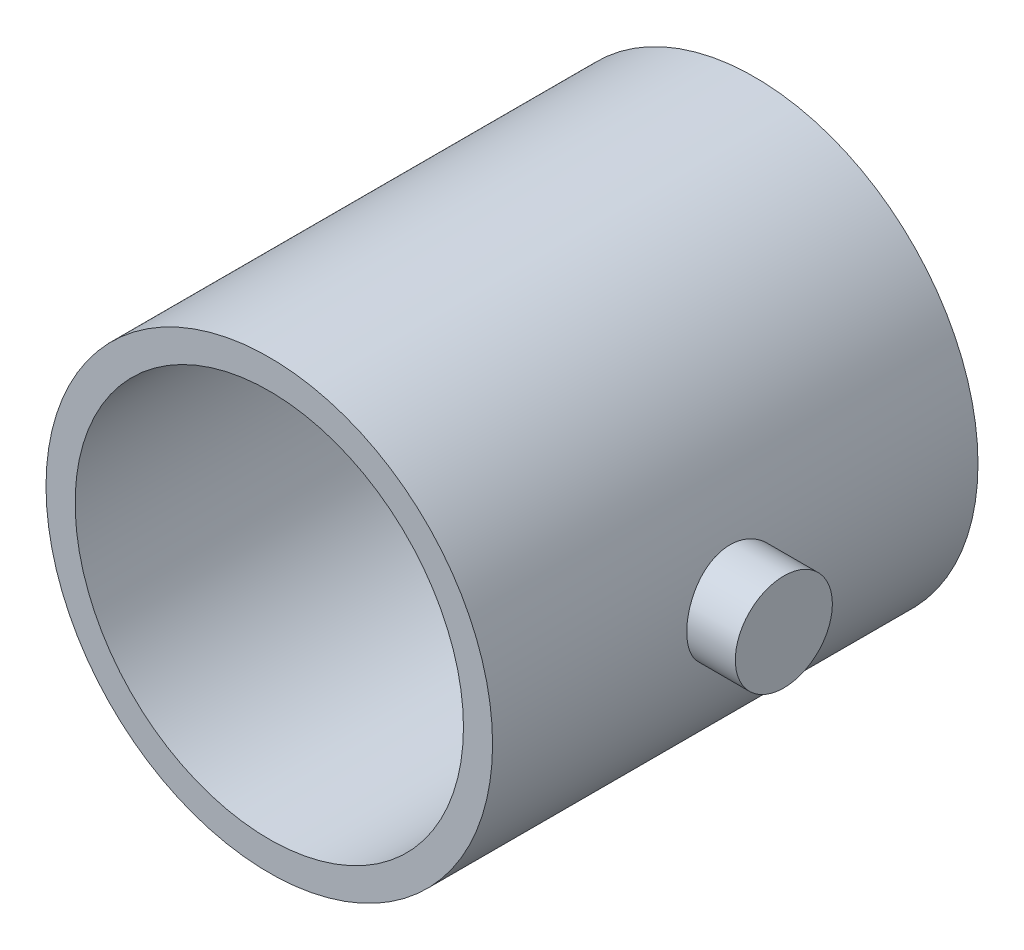
ISO-10303-21;
HEADER;
FILE_DESCRIPTION(('STEP AP214'),'2;1');
FILE_NAME('part.step','',(''),(''),'','','');
FILE_SCHEMA(('AUTOMOTIVE_DESIGN { 1 0 10303 214 1 1 1 1 }'));
ENDSEC;
DATA;
#1=APPLICATION_CONTEXT('core data for automotive mechanical design processes');
#2=APPLICATION_PROTOCOL_DEFINITION('international standard','automotive_design',2000,#1);
#3=PRODUCT_CONTEXT('',#1,'mechanical');
#4=PRODUCT('Part','Part','',(#3));
#5=PRODUCT_RELATED_PRODUCT_CATEGORY('part','',(#4));
#6=PRODUCT_DEFINITION_FORMATION('','',#4);
#7=PRODUCT_DEFINITION_CONTEXT('part definition',#1,'design');
#8=PRODUCT_DEFINITION('design','',#6,#7);
#9=PRODUCT_DEFINITION_SHAPE('','',#8);
#10=(LENGTH_UNIT() NAMED_UNIT(*) SI_UNIT(.MILLI.,.METRE.));
#11=(NAMED_UNIT(*) PLANE_ANGLE_UNIT() SI_UNIT($,.RADIAN.));
#12=(NAMED_UNIT(*) SI_UNIT($,.STERADIAN.) SOLID_ANGLE_UNIT());
#13=UNCERTAINTY_MEASURE_WITH_UNIT(LENGTH_MEASURE(1.E-05),#10,'distance_accuracy_value','');
#14=(GEOMETRIC_REPRESENTATION_CONTEXT(3) GLOBAL_UNCERTAINTY_ASSIGNED_CONTEXT((#13)) GLOBAL_UNIT_ASSIGNED_CONTEXT((#10,
#11,#12)) REPRESENTATION_CONTEXT('',''));
#15=CARTESIAN_POINT('',(0.,0.,0.));
#16=DIRECTION('',(0.,0.,1.));
#17=DIRECTION('',(1.,0.,0.));
#18=AXIS2_PLACEMENT_3D('',#15,#16,#17);
#19=CARTESIAN_POINT('',(1.11022302462516E-13,0.,24.9999999999999));
#20=DIRECTION('',(0.,0.,-1.));
#21=DIRECTION('',(-1.,0.,0.));
#22=AXIS2_PLACEMENT_3D('',#19,#20,#21);
#23=CYLINDRICAL_SURFACE('',#22,23.);
#24=CARTESIAN_POINT('',(1.11022302462516E-13,0.,24.9999999999999));
#25=DIRECTION('',(0.,0.,1.));
#26=DIRECTION('',(1.,0.,0.));
#27=AXIS2_PLACEMENT_3D('',#24,#25,#26);
#28=CIRCLE('',#27,23.);
#29=CARTESIAN_POINT('',(23.0000000000001,0.,24.9999999999999));
#30=VERTEX_POINT('',#29);
#31=EDGE_CURVE('E63',#30,#30,#28,.T.);
#32=ORIENTED_EDGE('',*,*,#31,.F.);
#33=EDGE_LOOP('',(#32));
#34=FACE_BOUND('',#33,.T.);
#35=CARTESIAN_POINT('',(0.,1.11022302462516E-13,-24.9999999999999));
#36=DIRECTION('',(0.,0.,1.));
#37=DIRECTION('',(1.,0.,0.));
#38=AXIS2_PLACEMENT_3D('',#35,#36,#37);
#39=CIRCLE('',#38,23.);
#40=CARTESIAN_POINT('',(23.,1.11022302462516E-13,-24.9999999999999));
#41=VERTEX_POINT('',#40);
#42=EDGE_CURVE('E67',#41,#41,#39,.T.);
#43=ORIENTED_EDGE('',*,*,#42,.T.);
#44=EDGE_LOOP('',(#43));
#45=FACE_BOUND('',#44,.T.);
#46=CARTESIAN_POINT('',(23.,0.,4.99999999999995));
#47=CARTESIAN_POINT('',(22.9999948787908,-0.277355453021735,4.99999046988133));
#48=CARTESIAN_POINT('',(22.9949320658385,-0.554826451597986,4.97684426926343));
#49=CARTESIAN_POINT('',(22.9752244645297,-1.10188982362927,4.88496546905839));
#50=CARTESIAN_POINT('',(22.9605727725136,-1.37147637435459,4.81620002471376));
#51=CARTESIAN_POINT('',(22.9233191130524,-1.89478531778498,4.63533607587976));
#52=CARTESIAN_POINT('',(22.9007254017299,-2.14852386391354,4.52328255955588));
#53=CARTESIAN_POINT('',(22.8500275043337,-2.63358953148524,4.25916536071906));
#54=CARTESIAN_POINT('',(22.8219234744707,-2.86491728796841,4.10710281237013));
#55=CARTESIAN_POINT('',(22.7627863133394,-3.30227374035058,3.76473115788667));
#56=CARTESIAN_POINT('',(22.7317172223452,-3.50789604525705,3.57390908094908));
#57=CARTESIAN_POINT('',(22.6704056016114,-3.88448132114956,3.16053646966976));
#58=CARTESIAN_POINT('',(22.640163145063,-4.05544123163071,2.93798313657933));
#59=CARTESIAN_POINT('',(22.5835746545546,-4.3596371455049,2.4644667572484));
#60=CARTESIAN_POINT('',(22.5572747128741,-4.49244139028528,2.21322034105574));
#61=CARTESIAN_POINT('',(22.5120647650812,-4.71378688871828,1.69131047335474));
#62=CARTESIAN_POINT('',(22.4931538869724,-4.80233336565282,1.42064931747878));
#63=CARTESIAN_POINT('',(22.4652292670019,-4.93130849540485,0.871998768853022));
#64=CARTESIAN_POINT('',(22.4560677930735,-4.97245619365541,0.59418608655001));
#65=CARTESIAN_POINT('',(22.4482355157402,-5.00770133737134,0.0354611643009783));
#66=CARTESIAN_POINT('',(22.4495634391116,-5.00180449319484,-0.245450695327375));
#67=CARTESIAN_POINT('',(22.4624261322471,-4.94370678921254,-0.797060666073154));
#68=CARTESIAN_POINT('',(22.4737769466231,-4.8923404136868,-1.06785160716687));
#69=CARTESIAN_POINT('',(22.5051157172029,-4.74608346550933,-1.59687823399914));
#70=CARTESIAN_POINT('',(22.5251041526852,-4.65119047766344,-1.85511322215649));
#71=CARTESIAN_POINT('',(22.5716477499978,-4.41980547322339,-2.35404788785901));
#72=CARTESIAN_POINT('',(22.598253368725,-4.28299185482642,-2.59459351716305));
#73=CARTESIAN_POINT('',(22.6550024959989,-3.97187541590613,-3.0496217824478));
#74=CARTESIAN_POINT('',(22.685146480994,-3.79756754406675,-3.26410090058628));
#75=CARTESIAN_POINT('',(22.7463657181789,-3.41198948927909,-3.66571305572729));
#76=CARTESIAN_POINT('',(22.7774471114846,-3.20000952055629,-3.85216437338838));
#77=CARTESIAN_POINT('',(22.8364526695469,-2.74743924196492,-4.18698068172868));
#78=CARTESIAN_POINT('',(22.8643767784509,-2.50684842612287,-4.33534499870512));
#79=CARTESIAN_POINT('',(22.9140103871413,-2.00305938410201,-4.58994109331086));
#80=CARTESIAN_POINT('',(22.9357068090615,-1.73981507074034,-4.69608438628192));
#81=CARTESIAN_POINT('',(22.9703430978099,-1.19865085335271,-4.86244154718178));
#82=CARTESIAN_POINT('',(22.9832842221095,-0.920733062974672,-4.92266201089122));
#83=CARTESIAN_POINT('',(22.9987731031789,-0.363959336093276,-4.99447447644619));
#84=CARTESIAN_POINT('',(23.0015198929516,-0.0852289048501575,-5.00699783996087));
#85=CARTESIAN_POINT('',(22.9968679964226,0.470341330213661,-4.98558382951362));
#86=CARTESIAN_POINT('',(22.9894699894329,0.747181259378003,-4.95164956643027));
#87=CARTESIAN_POINT('',(22.965485278793,1.28803214676812,-4.83905597636478));
#88=CARTESIAN_POINT('',(22.9489988257176,1.55214947691157,-4.76088436632724));
#89=CARTESIAN_POINT('',(22.9086822070421,2.06352339555361,-4.56257581121872));
#90=CARTESIAN_POINT('',(22.8848514210892,2.31077855760186,-4.4424353210525));
#91=CARTESIAN_POINT('',(22.8319982020036,2.78526633735588,-4.16165332702392));
#92=CARTESIAN_POINT('',(22.8029071864104,3.01216677511942,-4.00046367470691));
#93=CARTESIAN_POINT('',(22.742901927268,3.43603237038221,-3.64288165209545));
#94=CARTESIAN_POINT('',(22.7119874503518,3.6329936846753,-3.44648476938202));
#95=CARTESIAN_POINT('',(22.6511332836046,3.9950657714853,-3.01979189064552));
#96=CARTESIAN_POINT('',(22.6212215538578,4.159532015727,-2.78894425475482));
#97=CARTESIAN_POINT('',(22.5664022842386,4.44736358732948,-2.3023569619479));
#98=CARTESIAN_POINT('',(22.5414945287845,4.57073068547916,-2.0466183780913));
#99=CARTESIAN_POINT('',(22.4997392968969,4.77203416123024,-1.51887566100505));
#100=CARTESIAN_POINT('',(22.48284681229,4.85022477149138,-1.24697223924303));
#101=CARTESIAN_POINT('',(22.4589524877673,4.95970263165623,-0.693472130856952));
#102=CARTESIAN_POINT('',(22.4519490883793,4.99099727692894,-0.411876979759155));
#103=CARTESIAN_POINT('',(22.448723294638,5.00548311585465,0.146516635856317));
#104=CARTESIAN_POINT('',(22.4522719201585,4.98969596772684,0.423287764191333));
#105=CARTESIAN_POINT('',(22.469232947186,4.9127481979224,0.970125148838096));
#106=CARTESIAN_POINT('',(22.482645235379,4.8515880974913,1.24019148213785));
#107=CARTESIAN_POINT('',(22.5177114095499,4.68612139525899,1.76515348862382));
#108=CARTESIAN_POINT('',(22.5393372046593,4.58196175101842,2.02009748306306));
#109=CARTESIAN_POINT('',(22.5884050738285,4.33357956265605,2.5090440568203));
#110=CARTESIAN_POINT('',(22.6158477452533,4.18935290337308,2.74304448182229));
#111=CARTESIAN_POINT('',(22.6741425132552,3.86153463545073,3.1885016647199));
#112=CARTESIAN_POINT('',(22.7050517676777,3.67721419715373,3.39941468834916));
#113=CARTESIAN_POINT('',(22.7664110384028,3.27591964577114,3.78765215188844));
#114=CARTESIAN_POINT('',(22.796860946966,3.05893799910332,3.96496882114784));
#115=CARTESIAN_POINT('',(22.8543320283237,2.59513904625376,4.2831476716419));
#116=CARTESIAN_POINT('',(22.8813044059175,2.34797586446565,4.423514978119));
#117=CARTESIAN_POINT('',(22.9282925852266,1.83303166520976,4.66049163921958));
#118=CARTESIAN_POINT('',(22.9483142502148,1.56526825915437,4.75713789569372));
#119=CARTESIAN_POINT('',(22.9755491570463,1.08101000415973,4.88659361134451));
#120=CARTESIAN_POINT('',(22.9846616635847,0.867145659166218,4.92904026257736));
#121=CARTESIAN_POINT('',(22.996888966074,0.435544516373336,4.98574658873507));
#122=CARTESIAN_POINT('',(23.0000040216976,0.217807886644961,5.00000748402441));
#123=CARTESIAN_POINT('',(23.,0.,4.99999999999995));
#124=B_SPLINE_CURVE_WITH_KNOTS('',3,(#46,#47,#48,#49,#50,#51,#52,#53,#54,#55,#56,#57,#58,#59,
#60,#61,#62,#63,#64,#65,#66,#67,#68,#69,#70,#71,#72,#73,#74,#75,#76,#77,#78,#79,#80,#81,#82,#83,
#84,#85,#86,#87,#88,#89,#90,#91,#92,#93,#94,#95,#96,#97,#98,#99,#100,#101,#102,#103,#104,#105,
#106,#107,#108,#109,#110,#111,#112,#113,#114,#115,#116,#117,#118,#119,#120,#121,#122,#123),
.UNSPECIFIED.,.T.,.F.,(4,2,2,2,2,2,2,2,2,2,2,2,2,2,2,2,2,2,2,2,2,2,2,2,2,2,2,2,2,2,2,2,2,2,2,2,
2,2,4),(0.,0.831269128673627,1.66313740158704,2.49414345123022,3.32512594630146,4.1679214133339,
5.0107912623442,5.86285360379488,6.71481536147195,7.55367510208785,8.39243302182485,
9.21610950175423,10.039831691175,10.8700385218222,11.7003572700619,12.54840596434,
13.3964696583129,14.2463014329844,15.096011125451,15.9290411979394,16.7620154921012,
17.5859803211863,18.4100147671011,19.2456896220706,20.0814716599851,20.9324565116634,
21.7834046932497,22.6295162753477,23.4754944138518,24.3032496459051,25.1309953688343,
25.9559352605888,26.7809599107533,27.6224659338828,28.4641663557266,29.3166242337088,
30.168361263619,30.8211871228156,31.4739847158574),.UNSPECIFIED.);
#125=CARTESIAN_POINT('',(23.,0.,4.99999999999995));
#126=VERTEX_POINT('',#125);
#127=EDGE_CURVE('E12',#126,#126,#124,.T.);
#128=ORIENTED_EDGE('',*,*,#127,.F.);
#129=EDGE_LOOP('',(#128));
#130=FACE_BOUND('',#129,.T.);
#131=ADVANCED_FACE('F52',(#34,#45,#130),#23,.T.);
#132=CARTESIAN_POINT('',(1.11022302462516E-13,0.,24.9999999999999));
#133=DIRECTION('',(0.,0.,1.));
#134=DIRECTION('',(1.,0.,0.));
#135=AXIS2_PLACEMENT_3D('',#132,#133,#134);
#136=PLANE('',#135);
#137=ORIENTED_EDGE('',*,*,#31,.T.);
#138=EDGE_LOOP('',(#137));
#139=FACE_BOUND('',#138,.T.);
#140=CARTESIAN_POINT('',(1.11022302462516E-13,0.,24.9999999999999));
#141=DIRECTION('',(0.,0.,1.));
#142=DIRECTION('',(1.,0.,0.));
#143=AXIS2_PLACEMENT_3D('',#140,#141,#142);
#144=CIRCLE('',#143,20.);
#145=CARTESIAN_POINT('',(20.0000000000001,0.,24.9999999999999));
#146=VERTEX_POINT('',#145);
#147=EDGE_CURVE('E72',#146,#146,#144,.T.);
#148=ORIENTED_EDGE('',*,*,#147,.F.);
#149=EDGE_LOOP('',(#148));
#150=FACE_BOUND('',#149,.T.);
#151=ADVANCED_FACE('F98',(#139,#150),#136,.T.);
#152=CARTESIAN_POINT('',(0.,1.11022302462516E-13,-24.9999999999999));
#153=DIRECTION('',(0.,0.,1.));
#154=DIRECTION('',(1.,0.,0.));
#155=AXIS2_PLACEMENT_3D('',#152,#153,#154);
#156=PLANE('',#155);
#157=ORIENTED_EDGE('',*,*,#42,.F.);
#158=EDGE_LOOP('',(#157));
#159=FACE_BOUND('',#158,.T.);
#160=CARTESIAN_POINT('',(0.,1.11022302462516E-13,-24.9999999999999));
#161=DIRECTION('',(0.,0.,1.));
#162=DIRECTION('',(1.,0.,0.));
#163=AXIS2_PLACEMENT_3D('',#160,#161,#162);
#164=CIRCLE('',#163,20.);
#165=CARTESIAN_POINT('',(20.,1.11022302462516E-13,-24.9999999999999));
#166=VERTEX_POINT('',#165);
#167=EDGE_CURVE('E74',#166,#166,#164,.T.);
#168=ORIENTED_EDGE('',*,*,#167,.T.);
#169=EDGE_LOOP('',(#168));
#170=FACE_BOUND('',#169,.T.);
#171=ADVANCED_FACE('F93',(#159,#170),#156,.F.);
#172=CARTESIAN_POINT('',(1.11022302462516E-13,0.,24.9999999999999));
#173=DIRECTION('',(0.,0.,-1.));
#174=DIRECTION('',(-1.,0.,0.));
#175=AXIS2_PLACEMENT_3D('',#172,#173,#174);
#176=CYLINDRICAL_SURFACE('',#175,20.);
#177=ORIENTED_EDGE('',*,*,#147,.T.);
#178=EDGE_LOOP('',(#177));
#179=FACE_BOUND('',#178,.T.);
#180=ORIENTED_EDGE('',*,*,#167,.F.);
#181=EDGE_LOOP('',(#180));
#182=FACE_BOUND('',#181,.T.);
#183=ADVANCED_FACE('F87',(#179,#182),#176,.F.);
#184=CARTESIAN_POINT('',(27.9999999999999,0.,0.));
#185=DIRECTION('',(-1.,0.,0.));
#186=DIRECTION('',(0.,0.,1.));
#187=AXIS2_PLACEMENT_3D('',#184,#185,#186);
#188=CYLINDRICAL_SURFACE('',#187,5.);
#189=CARTESIAN_POINT('',(27.9999999999999,0.,0.));
#190=DIRECTION('',(1.,0.,0.));
#191=DIRECTION('',(0.,0.,-1.));
#192=AXIS2_PLACEMENT_3D('',#189,#190,#191);
#193=CIRCLE('',#192,5.);
#194=CARTESIAN_POINT('',(27.9999999999999,0.,-5.00000000000005));
#195=VERTEX_POINT('',#194);
#196=EDGE_CURVE('E77',#195,#195,#193,.T.);
#197=ORIENTED_EDGE('',*,*,#196,.F.);
#198=EDGE_LOOP('',(#197));
#199=FACE_BOUND('',#198,.T.);
#200=ORIENTED_EDGE('',*,*,#127,.T.);
#201=EDGE_LOOP('',(#200));
#202=FACE_BOUND('',#201,.T.);
#203=ADVANCED_FACE('F85',(#199,#202),#188,.T.);
#204=CARTESIAN_POINT('',(27.9999999999999,0.,0.));
#205=DIRECTION('',(1.,0.,0.));
#206=DIRECTION('',(0.,0.,-1.));
#207=AXIS2_PLACEMENT_3D('',#204,#205,#206);
#208=PLANE('',#207);
#209=ORIENTED_EDGE('',*,*,#196,.T.);
#210=EDGE_LOOP('',(#209));
#211=FACE_BOUND('',#210,.T.);
#212=ADVANCED_FACE('F83',(#211),#208,.T.);
#213=CLOSED_SHELL('',(#131,#151,#171,#183,#203,#212));
#214=MANIFOLD_SOLID_BREP('B2',#213);
#215=ADVANCED_BREP_SHAPE_REPRESENTATION('',(#18,#214),#14);
#216=SHAPE_DEFINITION_REPRESENTATION(#9,#215);
ENDSEC;
END-ISO-10303-21;
